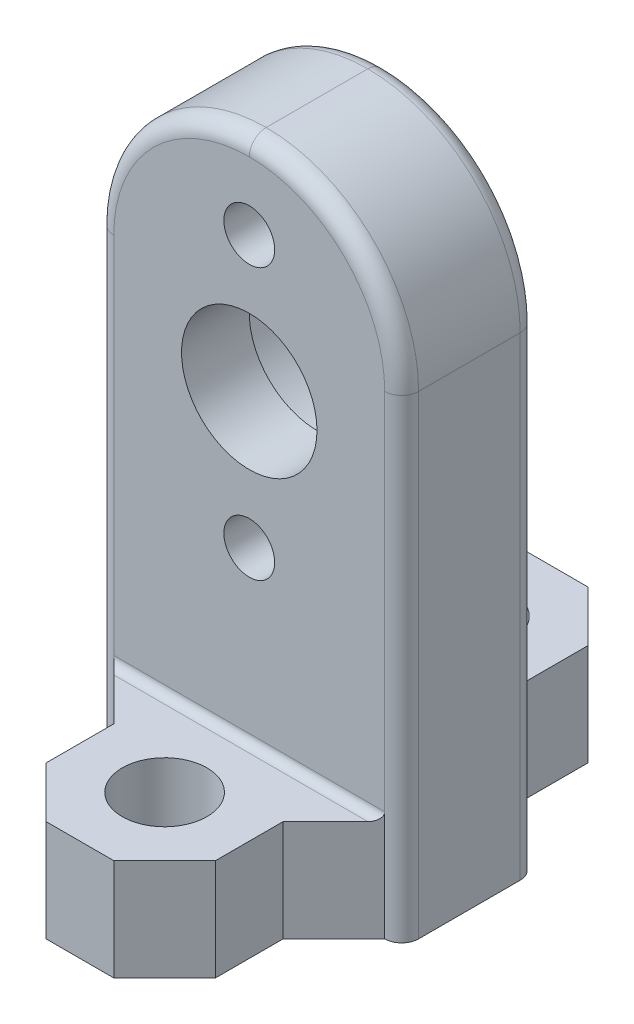
ISO-10303-21;
HEADER;
FILE_DESCRIPTION(('STEP AP214'),'2;1');
FILE_NAME('part.step','',(''),(''),'','','');
FILE_SCHEMA(('AUTOMOTIVE_DESIGN { 1 0 10303 214 1 1 1 1 }'));
ENDSEC;
DATA;
#1=APPLICATION_CONTEXT('core data for automotive mechanical design processes');
#2=APPLICATION_PROTOCOL_DEFINITION('international standard','automotive_design',2000,#1);
#3=PRODUCT_CONTEXT('',#1,'mechanical');
#4=PRODUCT('Part','Part','',(#3));
#5=PRODUCT_RELATED_PRODUCT_CATEGORY('part','',(#4));
#6=PRODUCT_DEFINITION_FORMATION('','',#4);
#7=PRODUCT_DEFINITION_CONTEXT('part definition',#1,'design');
#8=PRODUCT_DEFINITION('design','',#6,#7);
#9=PRODUCT_DEFINITION_SHAPE('','',#8);
#10=(LENGTH_UNIT() NAMED_UNIT(*) SI_UNIT(.MILLI.,.METRE.));
#11=(NAMED_UNIT(*) PLANE_ANGLE_UNIT() SI_UNIT($,.RADIAN.));
#12=(NAMED_UNIT(*) SI_UNIT($,.STERADIAN.) SOLID_ANGLE_UNIT());
#13=UNCERTAINTY_MEASURE_WITH_UNIT(LENGTH_MEASURE(1.E-05),#10,'distance_accuracy_value','');
#14=(GEOMETRIC_REPRESENTATION_CONTEXT(3) GLOBAL_UNCERTAINTY_ASSIGNED_CONTEXT((#13)) GLOBAL_UNIT_ASSIGNED_CONTEXT((#10,
#11,#12)) REPRESENTATION_CONTEXT('',''));
#15=CARTESIAN_POINT('',(0.,0.,0.));
#16=DIRECTION('',(0.,0.,1.));
#17=DIRECTION('',(1.,0.,0.));
#18=AXIS2_PLACEMENT_3D('',#15,#16,#17);
#19=CARTESIAN_POINT('',(-9.,0.,8.));
#20=DIRECTION('',(1.,0.,0.));
#21=DIRECTION('',(0.,1.,0.));
#22=AXIS2_PLACEMENT_3D('',#19,#20,#21);
#23=PLANE('',#22);
#24=DIRECTION('',(0.,0.,-1.));
#25=VECTOR('',#24,1.);
#26=CARTESIAN_POINT('',(-9.,4.,0.));
#27=LINE('',#26,#25);
#28=CARTESIAN_POINT('',(-9.,4.,7.));
#29=VERTEX_POINT('',#28);
#30=CARTESIAN_POINT('',(-9.,4.,1.));
#31=VERTEX_POINT('',#30);
#32=EDGE_CURVE('E423',#29,#31,#27,.T.);
#33=ORIENTED_EDGE('',*,*,#32,.T.);
#34=DIRECTION('',(0.,-1.,0.));
#35=VECTOR('',#34,1.);
#36=CARTESIAN_POINT('',(-9.,0.,1.));
#37=LINE('',#36,#35);
#38=CARTESIAN_POINT('',(-9.,-24.,1.));
#39=VERTEX_POINT('',#38);
#40=EDGE_CURVE('E286',#31,#39,#37,.T.);
#41=ORIENTED_EDGE('',*,*,#40,.T.);
#42=DIRECTION('',(0.,0.,-1.));
#43=VECTOR('',#42,1.);
#44=CARTESIAN_POINT('',(-9.,-24.,8.));
#45=LINE('',#44,#43);
#46=CARTESIAN_POINT('',(-9.,-24.,7.));
#47=VERTEX_POINT('',#46);
#48=EDGE_CURVE('E231',#47,#39,#45,.T.);
#49=ORIENTED_EDGE('',*,*,#48,.F.);
#50=DIRECTION('',(0.,-1.,0.));
#51=VECTOR('',#50,1.);
#52=CARTESIAN_POINT('',(-9.,4.,7.));
#53=LINE('',#52,#51);
#54=EDGE_CURVE('E284',#47,#29,#53,.F.);
#55=ORIENTED_EDGE('',*,*,#54,.T.);
#56=EDGE_LOOP('',(#33,#41,#49,#55));
#57=FACE_BOUND('',#56,.T.);
#58=ADVANCED_FACE('F35',(#57),#23,.F.);
#59=CARTESIAN_POINT('',(0.,-24.,8.));
#60=DIRECTION('',(0.,1.,0.));
#61=DIRECTION('',(0.,0.,1.));
#62=AXIS2_PLACEMENT_3D('',#59,#60,#61);
#63=PLANE('',#62);
#64=DIRECTION('',(0.,0.,-1.));
#65=VECTOR('',#64,1.);
#66=CARTESIAN_POINT('',(-5.,-24.,-10.));
#67=LINE('',#66,#65);
#68=CARTESIAN_POINT('',(-5.,-24.,-3.));
#69=VERTEX_POINT('',#68);
#70=CARTESIAN_POINT('',(-5.,-24.,-7.00000000000002));
#71=VERTEX_POINT('',#70);
#72=EDGE_CURVE('E395',#69,#71,#67,.T.);
#73=ORIENTED_EDGE('',*,*,#72,.T.);
#74=DIRECTION('',(-0.707106781186549,0.,0.707106781186546));
#75=VECTOR('',#74,1.);
#76=CARTESIAN_POINT('',(-5.,-24.,-7.00000000000002));
#77=LINE('',#76,#75);
#78=CARTESIAN_POINT('',(-2.,-24.,-10.));
#79=VERTEX_POINT('',#78);
#80=EDGE_CURVE('E353',#71,#79,#77,.F.);
#81=ORIENTED_EDGE('',*,*,#80,.T.);
#82=DIRECTION('',(1.,0.,0.));
#83=VECTOR('',#82,1.);
#84=CARTESIAN_POINT('',(5.,-24.,-10.));
#85=LINE('',#84,#83);
#86=CARTESIAN_POINT('',(2.,-24.,-10.));
#87=VERTEX_POINT('',#86);
#88=EDGE_CURVE('E394',#79,#87,#85,.T.);
#89=ORIENTED_EDGE('',*,*,#88,.T.);
#90=DIRECTION('',(-0.707106781186546,0.,-0.707106781186549));
#91=VECTOR('',#90,1.);
#92=CARTESIAN_POINT('',(2.,-24.,-10.));
#93=LINE('',#92,#91);
#94=CARTESIAN_POINT('',(5.,-24.,-6.99999999999999));
#95=VERTEX_POINT('',#94);
#96=EDGE_CURVE('E351',#87,#95,#93,.F.);
#97=ORIENTED_EDGE('',*,*,#96,.T.);
#98=DIRECTION('',(0.,0.,1.));
#99=VECTOR('',#98,1.);
#100=CARTESIAN_POINT('',(5.,-24.,-10.));
#101=LINE('',#100,#99);
#102=CARTESIAN_POINT('',(5.,-24.,-3.));
#103=VERTEX_POINT('',#102);
#104=EDGE_CURVE('E403',#95,#103,#101,.T.);
#105=ORIENTED_EDGE('',*,*,#104,.T.);
#106=DIRECTION('',(0.707106781186551,0.,0.707106781186544));
#107=VECTOR('',#106,1.);
#108=CARTESIAN_POINT('',(7.99999999999997,-24.,0.));
#109=LINE('',#108,#107);
#110=CARTESIAN_POINT('',(8.,-24.,0.));
#111=VERTEX_POINT('',#110);
#112=EDGE_CURVE('E223',#103,#111,#109,.T.);
#113=ORIENTED_EDGE('',*,*,#112,.T.);
#114=CARTESIAN_POINT('',(8.,-24.,1.));
#115=DIRECTION('',(0.,1.,0.));
#116=DIRECTION('',(0.,0.,1.));
#117=AXIS2_PLACEMENT_3D('',#114,#115,#116);
#118=CIRCLE('',#117,1.);
#119=CARTESIAN_POINT('',(9.,-24.,1.));
#120=VERTEX_POINT('',#119);
#121=EDGE_CURVE('E278',#111,#120,#118,.F.);
#122=ORIENTED_EDGE('',*,*,#121,.T.);
#123=DIRECTION('',(0.,0.,-1.));
#124=VECTOR('',#123,1.);
#125=CARTESIAN_POINT('',(9.,-24.,8.));
#126=LINE('',#125,#124);
#127=CARTESIAN_POINT('',(9.,-24.,7.));
#128=VERTEX_POINT('',#127);
#129=EDGE_CURVE('E417',#128,#120,#126,.T.);
#130=ORIENTED_EDGE('',*,*,#129,.F.);
#131=CARTESIAN_POINT('',(8.,-24.,7.));
#132=DIRECTION('',(0.,1.,0.));
#133=DIRECTION('',(0.,0.,1.));
#134=AXIS2_PLACEMENT_3D('',#131,#132,#133);
#135=CIRCLE('',#134,1.);
#136=CARTESIAN_POINT('',(8.,-24.,8.));
#137=VERTEX_POINT('',#136);
#138=EDGE_CURVE('E234',#128,#137,#135,.F.);
#139=ORIENTED_EDGE('',*,*,#138,.T.);
#140=DIRECTION('',(0.707106781186545,0.,-0.70710678118655));
#141=VECTOR('',#140,1.);
#142=CARTESIAN_POINT('',(4.00000000000003,-24.,12.));
#143=LINE('',#142,#141);
#144=CARTESIAN_POINT('',(5.,-24.,11.));
#145=VERTEX_POINT('',#144);
#146=EDGE_CURVE('E322',#137,#145,#143,.F.);
#147=ORIENTED_EDGE('',*,*,#146,.T.);
#148=CARTESIAN_POINT('',(5.,-24.,15.));
#149=VERTEX_POINT('',#148);
#150=EDGE_CURVE('E398',#145,#149,#101,.T.);
#151=ORIENTED_EDGE('',*,*,#150,.T.);
#152=DIRECTION('',(0.707106781186548,0.,-0.707106781186547));
#153=VECTOR('',#152,1.);
#154=CARTESIAN_POINT('',(5.,-24.,15.));
#155=LINE('',#154,#153);
#156=CARTESIAN_POINT('',(2.,-24.,18.));
#157=VERTEX_POINT('',#156);
#158=EDGE_CURVE('E347',#149,#157,#155,.F.);
#159=ORIENTED_EDGE('',*,*,#158,.T.);
#160=DIRECTION('',(-1.,0.,0.));
#161=VECTOR('',#160,1.);
#162=CARTESIAN_POINT('',(5.,-24.,18.));
#163=LINE('',#162,#161);
#164=CARTESIAN_POINT('',(-2.00000000000001,-24.,18.));
#165=VERTEX_POINT('',#164);
#166=EDGE_CURVE('E391',#157,#165,#163,.T.);
#167=ORIENTED_EDGE('',*,*,#166,.T.);
#168=DIRECTION('',(0.707106781186546,0.,0.707106781186549));
#169=VECTOR('',#168,1.);
#170=CARTESIAN_POINT('',(-2.00000000000001,-24.,18.));
#171=LINE('',#170,#169);
#172=CARTESIAN_POINT('',(-5.,-24.,15.));
#173=VERTEX_POINT('',#172);
#174=EDGE_CURVE('E349',#165,#173,#171,.F.);
#175=ORIENTED_EDGE('',*,*,#174,.T.);
#176=CARTESIAN_POINT('',(-5.,-24.,11.));
#177=VERTEX_POINT('',#176);
#178=EDGE_CURVE('E389',#173,#177,#67,.T.);
#179=ORIENTED_EDGE('',*,*,#178,.T.);
#180=DIRECTION('',(0.707106781186544,0.,0.707106781186551));
#181=VECTOR('',#180,1.);
#182=CARTESIAN_POINT('',(-4.00000000000003,-24.,12.));
#183=LINE('',#182,#181);
#184=CARTESIAN_POINT('',(-8.,-24.,8.));
#185=VERTEX_POINT('',#184);
#186=EDGE_CURVE('E336',#177,#185,#183,.F.);
#187=ORIENTED_EDGE('',*,*,#186,.T.);
#188=CARTESIAN_POINT('',(-8.,-24.,7.));
#189=DIRECTION('',(0.,1.,0.));
#190=DIRECTION('',(0.,0.,1.));
#191=AXIS2_PLACEMENT_3D('',#188,#189,#190);
#192=CIRCLE('',#191,1.);
#193=EDGE_CURVE('E235',#185,#47,#192,.F.);
#194=ORIENTED_EDGE('',*,*,#193,.T.);
#195=ORIENTED_EDGE('',*,*,#48,.T.);
#196=CARTESIAN_POINT('',(-8.,-24.,1.));
#197=DIRECTION('',(0.,1.,0.));
#198=DIRECTION('',(0.,0.,1.));
#199=AXIS2_PLACEMENT_3D('',#196,#197,#198);
#200=CIRCLE('',#199,1.);
#201=CARTESIAN_POINT('',(-8.,-24.,0.));
#202=VERTEX_POINT('',#201);
#203=EDGE_CURVE('E227',#39,#202,#200,.F.);
#204=ORIENTED_EDGE('',*,*,#203,.T.);
#205=DIRECTION('',(0.707106781186551,0.,-0.707106781186544));
#206=VECTOR('',#205,1.);
#207=CARTESIAN_POINT('',(-7.99999999999997,-24.,0.));
#208=LINE('',#207,#206);
#209=EDGE_CURVE('E211',#202,#69,#208,.T.);
#210=ORIENTED_EDGE('',*,*,#209,.T.);
#211=EDGE_LOOP('',(#73,#81,#89,#97,#105,#113,#122,#130,#139,#147,#151,#159,#167,#175,#179,#187,
#194,#195,#204,#210));
#212=FACE_BOUND('',#211,.T.);
#213=CARTESIAN_POINT('',(0.,-24.,-5.));
#214=DIRECTION('',(0.,-1.,0.));
#215=DIRECTION('',(0.,0.,1.));
#216=AXIS2_PLACEMENT_3D('',#213,#214,#215);
#217=CIRCLE('',#216,2.5);
#218=CARTESIAN_POINT('',(0.,-24.,-2.5));
#219=VERTEX_POINT('',#218);
#220=EDGE_CURVE('E298',#219,#219,#217,.T.);
#221=ORIENTED_EDGE('',*,*,#220,.F.);
#222=EDGE_LOOP('',(#221));
#223=FACE_BOUND('',#222,.T.);
#224=CARTESIAN_POINT('',(0.,-24.,13.));
#225=DIRECTION('',(0.,-1.,0.));
#226=DIRECTION('',(0.,0.,-1.));
#227=AXIS2_PLACEMENT_3D('',#224,#225,#226);
#228=CIRCLE('',#227,2.5);
#229=CARTESIAN_POINT('',(0.,-24.,10.5));
#230=VERTEX_POINT('',#229);
#231=EDGE_CURVE('E485',#230,#230,#228,.T.);
#232=ORIENTED_EDGE('',*,*,#231,.F.);
#233=EDGE_LOOP('',(#232));
#234=FACE_BOUND('',#233,.T.);
#235=ADVANCED_FACE('F228',(#212,#223,#234),#63,.F.);
#236=CARTESIAN_POINT('',(9.,0.,8.));
#237=DIRECTION('',(1.,0.,0.));
#238=DIRECTION('',(0.,1.,0.));
#239=AXIS2_PLACEMENT_3D('',#236,#237,#238);
#240=PLANE('',#239);
#241=ORIENTED_EDGE('',*,*,#129,.T.);
#242=DIRECTION('',(0.,-1.,0.));
#243=VECTOR('',#242,1.);
#244=CARTESIAN_POINT('',(9.,4.,1.));
#245=LINE('',#244,#243);
#246=CARTESIAN_POINT('',(9.,4.,1.));
#247=VERTEX_POINT('',#246);
#248=EDGE_CURVE('E282',#120,#247,#245,.F.);
#249=ORIENTED_EDGE('',*,*,#248,.T.);
#250=DIRECTION('',(0.,0.,-1.));
#251=VECTOR('',#250,1.);
#252=CARTESIAN_POINT('',(9.,4.,8.));
#253=LINE('',#252,#251);
#254=CARTESIAN_POINT('',(9.,4.,7.));
#255=VERTEX_POINT('',#254);
#256=EDGE_CURVE('E426',#247,#255,#253,.F.);
#257=ORIENTED_EDGE('',*,*,#256,.T.);
#258=DIRECTION('',(0.,-1.,0.));
#259=VECTOR('',#258,1.);
#260=CARTESIAN_POINT('',(9.,0.,7.));
#261=LINE('',#260,#259);
#262=EDGE_CURVE('E280',#255,#128,#261,.T.);
#263=ORIENTED_EDGE('',*,*,#262,.T.);
#264=EDGE_LOOP('',(#241,#249,#257,#263));
#265=FACE_BOUND('',#264,.T.);
#266=ADVANCED_FACE('F532',(#265),#240,.T.);
#267=CARTESIAN_POINT('',(0.,0.,8.));
#268=DIRECTION('',(0.,0.,1.));
#269=DIRECTION('',(1.,0.,0.));
#270=AXIS2_PLACEMENT_3D('',#267,#268,#269);
#271=PLANE('',#270);
#272=CARTESIAN_POINT('',(0.,8.,8.));
#273=DIRECTION('',(0.,0.,1.));
#274=DIRECTION('',(1.,0.,0.));
#275=AXIS2_PLACEMENT_3D('',#272,#273,#274);
#276=CIRCLE('',#275,1.5);
#277=CARTESIAN_POINT('',(1.49999999999994,8.,8.));
#278=VERTEX_POINT('',#277);
#279=EDGE_CURVE('E302',#278,#278,#276,.T.);
#280=ORIENTED_EDGE('',*,*,#279,.F.);
#281=EDGE_LOOP('',(#280));
#282=FACE_BOUND('',#281,.T.);
#283=CARTESIAN_POINT('',(1.12707120282298E-13,-8.,8.));
#284=DIRECTION('',(0.,0.,1.));
#285=DIRECTION('',(1.,0.,0.));
#286=AXIS2_PLACEMENT_3D('',#283,#284,#285);
#287=CIRCLE('',#286,1.5);
#288=CARTESIAN_POINT('',(1.50000000000011,-8.,8.));
#289=VERTEX_POINT('',#288);
#290=EDGE_CURVE('E792',#289,#289,#287,.T.);
#291=ORIENTED_EDGE('',*,*,#290,.F.);
#292=EDGE_LOOP('',(#291));
#293=FACE_BOUND('',#292,.T.);
#294=DIRECTION('',(1.,0.,0.));
#295=VECTOR('',#294,1.);
#296=CARTESIAN_POINT('',(0.,-17.5,8.));
#297=LINE('',#296,#295);
#298=CARTESIAN_POINT('',(-8.,-17.5,8.));
#299=VERTEX_POINT('',#298);
#300=CARTESIAN_POINT('',(8.,-17.5,8.));
#301=VERTEX_POINT('',#300);
#302=EDGE_CURVE('E434',#299,#301,#297,.T.);
#303=ORIENTED_EDGE('',*,*,#302,.T.);
#304=DIRECTION('',(0.,-1.,0.));
#305=VECTOR('',#304,1.);
#306=CARTESIAN_POINT('',(8.,0.,8.));
#307=LINE('',#306,#305);
#308=CARTESIAN_POINT('',(8.,4.,8.));
#309=VERTEX_POINT('',#308);
#310=EDGE_CURVE('E272',#301,#309,#307,.F.);
#311=ORIENTED_EDGE('',*,*,#310,.T.);
#312=CARTESIAN_POINT('',(0.,4.,8.));
#313=DIRECTION('',(0.,0.,1.));
#314=DIRECTION('',(1.,0.,0.));
#315=AXIS2_PLACEMENT_3D('',#312,#313,#314);
#316=CIRCLE('',#315,8.);
#317=CARTESIAN_POINT('',(0.,12.,8.));
#318=VERTEX_POINT('',#317);
#319=EDGE_CURVE('E269',#309,#318,#316,.T.);
#320=ORIENTED_EDGE('',*,*,#319,.T.);
#321=CARTESIAN_POINT('',(0.,4.,8.));
#322=DIRECTION('',(0.,0.,1.));
#323=DIRECTION('',(1.,0.,0.));
#324=AXIS2_PLACEMENT_3D('',#321,#322,#323);
#325=CIRCLE('',#324,8.);
#326=CARTESIAN_POINT('',(-8.,4.,8.));
#327=VERTEX_POINT('',#326);
#328=EDGE_CURVE('E267',#318,#327,#325,.T.);
#329=ORIENTED_EDGE('',*,*,#328,.T.);
#330=DIRECTION('',(0.,-1.,0.));
#331=VECTOR('',#330,1.);
#332=CARTESIAN_POINT('',(-8.,-24.,8.));
#333=LINE('',#332,#331);
#334=EDGE_CURVE('E264',#327,#299,#333,.T.);
#335=ORIENTED_EDGE('',*,*,#334,.T.);
#336=EDGE_LOOP('',(#303,#311,#320,#329,#335));
#337=FACE_BOUND('',#336,.T.);
#338=CARTESIAN_POINT('',(0.,0.,8.));
#339=DIRECTION('',(0.,0.,1.));
#340=DIRECTION('',(1.,0.,0.));
#341=AXIS2_PLACEMENT_3D('',#338,#339,#340);
#342=CIRCLE('',#341,4.);
#343=CARTESIAN_POINT('',(4.,0.,8.));
#344=VERTEX_POINT('',#343);
#345=EDGE_CURVE('E407',#344,#344,#342,.T.);
#346=ORIENTED_EDGE('',*,*,#345,.F.);
#347=EDGE_LOOP('',(#346));
#348=FACE_BOUND('',#347,.T.);
#349=ADVANCED_FACE('F509',(#282,#293,#337,#348),#271,.T.);
#350=CARTESIAN_POINT('',(0.,0.,0.));
#351=DIRECTION('',(0.,0.,1.));
#352=DIRECTION('',(1.,0.,0.));
#353=AXIS2_PLACEMENT_3D('',#350,#351,#352);
#354=PLANE('',#353);
#355=CARTESIAN_POINT('',(0.,8.,0.));
#356=DIRECTION('',(0.,0.,-1.));
#357=DIRECTION('',(1.,0.,0.));
#358=AXIS2_PLACEMENT_3D('',#355,#356,#357);
#359=CIRCLE('',#358,1.5);
#360=CARTESIAN_POINT('',(1.49999999999994,8.,0.));
#361=VERTEX_POINT('',#360);
#362=EDGE_CURVE('E791',#361,#361,#359,.T.);
#363=ORIENTED_EDGE('',*,*,#362,.F.);
#364=EDGE_LOOP('',(#363));
#365=FACE_BOUND('',#364,.T.);
#366=CARTESIAN_POINT('',(1.12707120282298E-13,-8.,0.));
#367=DIRECTION('',(0.,0.,-1.));
#368=DIRECTION('',(1.,0.,0.));
#369=AXIS2_PLACEMENT_3D('',#366,#367,#368);
#370=CIRCLE('',#369,1.5);
#371=CARTESIAN_POINT('',(1.50000000000011,-8.,0.));
#372=VERTEX_POINT('',#371);
#373=EDGE_CURVE('E793',#372,#372,#370,.T.);
#374=ORIENTED_EDGE('',*,*,#373,.F.);
#375=EDGE_LOOP('',(#374));
#376=FACE_BOUND('',#375,.T.);
#377=CARTESIAN_POINT('',(0.,0.,0.));
#378=DIRECTION('',(0.,0.,1.));
#379=DIRECTION('',(1.,0.,0.));
#380=AXIS2_PLACEMENT_3D('',#377,#378,#379);
#381=CIRCLE('',#380,6.);
#382=CARTESIAN_POINT('',(6.,0.,0.));
#383=VERTEX_POINT('',#382);
#384=EDGE_CURVE('E413',#383,#383,#381,.T.);
#385=ORIENTED_EDGE('',*,*,#384,.T.);
#386=EDGE_LOOP('',(#385));
#387=FACE_BOUND('',#386,.T.);
#388=DIRECTION('',(0.,-1.,0.));
#389=VECTOR('',#388,1.);
#390=CARTESIAN_POINT('',(8.,-24.,0.));
#391=LINE('',#390,#389);
#392=CARTESIAN_POINT('',(8.,4.,0.));
#393=VERTEX_POINT('',#392);
#394=CARTESIAN_POINT('',(8.,-17.5,0.));
#395=VERTEX_POINT('',#394);
#396=EDGE_CURVE('E252',#393,#395,#391,.T.);
#397=ORIENTED_EDGE('',*,*,#396,.T.);
#398=DIRECTION('',(1.,0.,0.));
#399=VECTOR('',#398,1.);
#400=CARTESIAN_POINT('',(-5.,-17.5,0.));
#401=LINE('',#400,#399);
#402=CARTESIAN_POINT('',(-8.,-17.5,0.));
#403=VERTEX_POINT('',#402);
#404=EDGE_CURVE('E433',#395,#403,#401,.F.);
#405=ORIENTED_EDGE('',*,*,#404,.T.);
#406=DIRECTION('',(0.,-1.,0.));
#407=VECTOR('',#406,1.);
#408=CARTESIAN_POINT('',(-8.,0.,0.));
#409=LINE('',#408,#407);
#410=CARTESIAN_POINT('',(-8.,4.,0.));
#411=VERTEX_POINT('',#410);
#412=EDGE_CURVE('E240',#403,#411,#409,.F.);
#413=ORIENTED_EDGE('',*,*,#412,.T.);
#414=CARTESIAN_POINT('',(0.,4.,0.));
#415=DIRECTION('',(0.,0.,1.));
#416=DIRECTION('',(1.,0.,0.));
#417=AXIS2_PLACEMENT_3D('',#414,#415,#416);
#418=CIRCLE('',#417,8.);
#419=CARTESIAN_POINT('',(0.,12.,0.));
#420=VERTEX_POINT('',#419);
#421=EDGE_CURVE('E241',#411,#420,#418,.F.);
#422=ORIENTED_EDGE('',*,*,#421,.T.);
#423=CARTESIAN_POINT('',(0.,4.,0.));
#424=DIRECTION('',(0.,0.,1.));
#425=DIRECTION('',(1.,0.,0.));
#426=AXIS2_PLACEMENT_3D('',#423,#424,#425);
#427=CIRCLE('',#426,8.);
#428=EDGE_CURVE('E243',#420,#393,#427,.F.);
#429=ORIENTED_EDGE('',*,*,#428,.T.);
#430=EDGE_LOOP('',(#397,#405,#413,#422,#429));
#431=FACE_BOUND('',#430,.T.);
#432=ADVANCED_FACE('F469',(#365,#376,#387,#431),#354,.F.);
#433=CARTESIAN_POINT('',(0.,0.,4.));
#434=DIRECTION('',(0.,0.,-1.));
#435=DIRECTION('',(-1.,0.,0.));
#436=AXIS2_PLACEMENT_3D('',#433,#434,#435);
#437=CYLINDRICAL_SURFACE('',#436,6.);
#438=CARTESIAN_POINT('',(0.,0.,4.));
#439=DIRECTION('',(0.,0.,1.));
#440=DIRECTION('',(1.,0.,0.));
#441=AXIS2_PLACEMENT_3D('',#438,#439,#440);
#442=CIRCLE('',#441,6.);
#443=CARTESIAN_POINT('',(6.,0.,4.));
#444=VERTEX_POINT('',#443);
#445=EDGE_CURVE('E414',#444,#444,#442,.T.);
#446=ORIENTED_EDGE('',*,*,#445,.T.);
#447=EDGE_LOOP('',(#446));
#448=FACE_BOUND('',#447,.T.);
#449=ORIENTED_EDGE('',*,*,#384,.F.);
#450=EDGE_LOOP('',(#449));
#451=FACE_BOUND('',#450,.T.);
#452=ADVANCED_FACE('F763',(#448,#451),#437,.F.);
#453=CARTESIAN_POINT('',(0.,0.,4.));
#454=DIRECTION('',(0.,0.,1.));
#455=DIRECTION('',(1.,0.,0.));
#456=AXIS2_PLACEMENT_3D('',#453,#454,#455);
#457=PLANE('',#456);
#458=CARTESIAN_POINT('',(0.,0.,4.));
#459=DIRECTION('',(0.,0.,1.));
#460=DIRECTION('',(1.,0.,0.));
#461=AXIS2_PLACEMENT_3D('',#458,#459,#460);
#462=CIRCLE('',#461,4.);
#463=CARTESIAN_POINT('',(4.,0.,4.));
#464=VERTEX_POINT('',#463);
#465=EDGE_CURVE('E410',#464,#464,#462,.F.);
#466=ORIENTED_EDGE('',*,*,#465,.F.);
#467=EDGE_LOOP('',(#466));
#468=FACE_BOUND('',#467,.T.);
#469=ORIENTED_EDGE('',*,*,#445,.F.);
#470=EDGE_LOOP('',(#469));
#471=FACE_BOUND('',#470,.T.);
#472=ADVANCED_FACE('F768',(#468,#471),#457,.F.);
#473=CARTESIAN_POINT('',(0.,0.,-7.31370849898476));
#474=DIRECTION('',(0.,0.,1.));
#475=DIRECTION('',(1.,0.,0.));
#476=AXIS2_PLACEMENT_3D('',#473,#474,#475);
#477=CYLINDRICAL_SURFACE('',#476,4.);
#478=ORIENTED_EDGE('',*,*,#465,.T.);
#479=EDGE_LOOP('',(#478));
#480=FACE_BOUND('',#479,.T.);
#481=ORIENTED_EDGE('',*,*,#345,.T.);
#482=EDGE_LOOP('',(#481));
#483=FACE_BOUND('',#482,.T.);
#484=ADVANCED_FACE('F542',(#480,#483),#477,.F.);
#485=CARTESIAN_POINT('',(0.,4.,8.));
#486=DIRECTION('',(0.,0.,-1.));
#487=DIRECTION('',(-1.,0.,0.));
#488=AXIS2_PLACEMENT_3D('',#485,#486,#487);
#489=CYLINDRICAL_SURFACE('',#488,9.);
#490=ORIENTED_EDGE('',*,*,#256,.F.);
#491=CARTESIAN_POINT('',(0.,4.,1.));
#492=DIRECTION('',(0.,0.,1.));
#493=DIRECTION('',(1.,0.,0.));
#494=AXIS2_PLACEMENT_3D('',#491,#492,#493);
#495=CIRCLE('',#494,9.);
#496=CARTESIAN_POINT('',(0.,13.,1.));
#497=VERTEX_POINT('',#496);
#498=EDGE_CURVE('E257',#247,#497,#495,.T.);
#499=ORIENTED_EDGE('',*,*,#498,.T.);
#500=DIRECTION('',(0.,0.,-1.));
#501=VECTOR('',#500,1.);
#502=CARTESIAN_POINT('',(0.,13.,8.));
#503=LINE('',#502,#501);
#504=CARTESIAN_POINT('',(0.,13.,7.));
#505=VERTEX_POINT('',#504);
#506=EDGE_CURVE('E385',#505,#497,#503,.T.);
#507=ORIENTED_EDGE('',*,*,#506,.F.);
#508=CARTESIAN_POINT('',(0.,4.,7.));
#509=DIRECTION('',(0.,0.,1.));
#510=DIRECTION('',(1.,0.,0.));
#511=AXIS2_PLACEMENT_3D('',#508,#509,#510);
#512=CIRCLE('',#511,9.);
#513=EDGE_CURVE('E255',#505,#255,#512,.F.);
#514=ORIENTED_EDGE('',*,*,#513,.T.);
#515=EDGE_LOOP('',(#490,#499,#507,#514));
#516=FACE_BOUND('',#515,.T.);
#517=ADVANCED_FACE('F539',(#516),#489,.T.);
#518=CARTESIAN_POINT('',(0.,4.,8.));
#519=DIRECTION('',(0.,0.,1.));
#520=DIRECTION('',(1.,0.,0.));
#521=AXIS2_PLACEMENT_3D('',#518,#519,#520);
#522=CYLINDRICAL_SURFACE('',#521,9.);
#523=ORIENTED_EDGE('',*,*,#506,.T.);
#524=CARTESIAN_POINT('',(0.,4.,1.));
#525=DIRECTION('',(0.,0.,1.));
#526=DIRECTION('',(1.,0.,0.));
#527=AXIS2_PLACEMENT_3D('',#524,#525,#526);
#528=CIRCLE('',#527,9.);
#529=EDGE_CURVE('E261',#497,#31,#528,.T.);
#530=ORIENTED_EDGE('',*,*,#529,.T.);
#531=ORIENTED_EDGE('',*,*,#32,.F.);
#532=CARTESIAN_POINT('',(0.,4.,7.));
#533=DIRECTION('',(0.,0.,1.));
#534=DIRECTION('',(1.,0.,0.));
#535=AXIS2_PLACEMENT_3D('',#532,#533,#534);
#536=CIRCLE('',#535,9.);
#537=EDGE_CURVE('E259',#29,#505,#536,.F.);
#538=ORIENTED_EDGE('',*,*,#537,.T.);
#539=EDGE_LOOP('',(#523,#530,#531,#538));
#540=FACE_BOUND('',#539,.T.);
#541=ADVANCED_FACE('F455',(#540),#522,.T.);
#542=CARTESIAN_POINT('',(5.,-18.,-10.));
#543=DIRECTION('',(0.,0.,-1.));
#544=DIRECTION('',(-1.,0.,0.));
#545=AXIS2_PLACEMENT_3D('',#542,#543,#544);
#546=PLANE('',#545);
#547=ORIENTED_EDGE('',*,*,#88,.F.);
#548=DIRECTION('',(0.,1.,0.));
#549=VECTOR('',#548,1.);
#550=CARTESIAN_POINT('',(-2.,-18.,-10.));
#551=LINE('',#550,#549);
#552=CARTESIAN_POINT('',(-2.,-18.,-10.));
#553=VERTEX_POINT('',#552);
#554=EDGE_CURVE('E358',#79,#553,#551,.T.);
#555=ORIENTED_EDGE('',*,*,#554,.T.);
#556=DIRECTION('',(1.,0.,0.));
#557=VECTOR('',#556,1.);
#558=CARTESIAN_POINT('',(5.,-18.,-10.));
#559=LINE('',#558,#557);
#560=CARTESIAN_POINT('',(2.,-18.,-10.));
#561=VERTEX_POINT('',#560);
#562=EDGE_CURVE('E482',#553,#561,#559,.T.);
#563=ORIENTED_EDGE('',*,*,#562,.T.);
#564=DIRECTION('',(0.,-1.,0.));
#565=VECTOR('',#564,1.);
#566=CARTESIAN_POINT('',(2.,-18.,-10.));
#567=LINE('',#566,#565);
#568=EDGE_CURVE('E355',#561,#87,#567,.T.);
#569=ORIENTED_EDGE('',*,*,#568,.T.);
#570=EDGE_LOOP('',(#547,#555,#563,#569));
#571=FACE_BOUND('',#570,.T.);
#572=ADVANCED_FACE('F538',(#571),#546,.T.);
#573=CARTESIAN_POINT('',(0.,-18.,-5.));
#574=DIRECTION('',(0.,-1.,0.));
#575=DIRECTION('',(0.,0.,-1.));
#576=AXIS2_PLACEMENT_3D('',#573,#574,#575);
#577=CYLINDRICAL_SURFACE('',#576,2.5);
#578=CARTESIAN_POINT('',(0.,-18.,-5.));
#579=DIRECTION('',(0.,-1.,0.));
#580=DIRECTION('',(0.,0.,1.));
#581=AXIS2_PLACEMENT_3D('',#578,#579,#580);
#582=CIRCLE('',#581,2.5);
#583=CARTESIAN_POINT('',(0.,-18.,-2.5));
#584=VERTEX_POINT('',#583);
#585=EDGE_CURVE('E801',#584,#584,#582,.T.);
#586=ORIENTED_EDGE('',*,*,#585,.F.);
#587=EDGE_LOOP('',(#586));
#588=FACE_BOUND('',#587,.T.);
#589=ORIENTED_EDGE('',*,*,#220,.T.);
#590=EDGE_LOOP('',(#589));
#591=FACE_BOUND('',#590,.T.);
#592=ADVANCED_FACE('F644',(#588,#591),#577,.F.);
#593=CARTESIAN_POINT('',(0.,-18.,0.));
#594=DIRECTION('',(0.,-1.,0.));
#595=DIRECTION('',(0.,0.,-1.));
#596=AXIS2_PLACEMENT_3D('',#593,#594,#595);
#597=PLANE('',#596);
#598=ORIENTED_EDGE('',*,*,#585,.T.);
#599=EDGE_LOOP('',(#598));
#600=FACE_BOUND('',#599,.T.);
#601=ORIENTED_EDGE('',*,*,#562,.F.);
#602=DIRECTION('',(0.707106781186549,0.,-0.707106781186546));
#603=VECTOR('',#602,1.);
#604=CARTESIAN_POINT('',(-5.,-18.,-7.00000000000002));
#605=LINE('',#604,#603);
#606=CARTESIAN_POINT('',(-5.,-18.,-7.00000000000002));
#607=VERTEX_POINT('',#606);
#608=EDGE_CURVE('E362',#553,#607,#605,.F.);
#609=ORIENTED_EDGE('',*,*,#608,.T.);
#610=DIRECTION('',(0.,0.,-1.));
#611=VECTOR('',#610,1.);
#612=CARTESIAN_POINT('',(-5.,-18.,-10.));
#613=LINE('',#612,#611);
#614=CARTESIAN_POINT('',(-5.,-18.,-3.));
#615=VERTEX_POINT('',#614);
#616=EDGE_CURVE('E406',#615,#607,#613,.T.);
#617=ORIENTED_EDGE('',*,*,#616,.F.);
#618=DIRECTION('',(-0.707106781186551,0.,0.707106781186544));
#619=VECTOR('',#618,1.);
#620=CARTESIAN_POINT('',(-3.99999999999997,-18.,-4.00000000000001));
#621=LINE('',#620,#619);
#622=CARTESIAN_POINT('',(-7.50000000000002,-18.,-0.5));
#623=VERTEX_POINT('',#622);
#624=EDGE_CURVE('E222',#615,#623,#621,.T.);
#625=ORIENTED_EDGE('',*,*,#624,.T.);
#626=DIRECTION('',(1.,0.,0.));
#627=VECTOR('',#626,1.);
#628=CARTESIAN_POINT('',(5.,-18.,-0.5));
#629=LINE('',#628,#627);
#630=CARTESIAN_POINT('',(7.50000000000002,-18.,-0.5));
#631=VERTEX_POINT('',#630);
#632=EDGE_CURVE('E429',#623,#631,#629,.T.);
#633=ORIENTED_EDGE('',*,*,#632,.T.);
#634=DIRECTION('',(-0.707106781186551,0.,-0.707106781186544));
#635=VECTOR('',#634,1.);
#636=CARTESIAN_POINT('',(3.99999999999997,-18.,-4.00000000000001));
#637=LINE('',#636,#635);
#638=CARTESIAN_POINT('',(5.,-18.,-3.));
#639=VERTEX_POINT('',#638);
#640=EDGE_CURVE('E327',#631,#639,#637,.T.);
#641=ORIENTED_EDGE('',*,*,#640,.T.);
#642=DIRECTION('',(0.,0.,1.));
#643=VECTOR('',#642,1.);
#644=CARTESIAN_POINT('',(5.,-18.,-10.));
#645=LINE('',#644,#643);
#646=CARTESIAN_POINT('',(5.,-18.,-6.99999999999999));
#647=VERTEX_POINT('',#646);
#648=EDGE_CURVE('E386',#647,#639,#645,.T.);
#649=ORIENTED_EDGE('',*,*,#648,.F.);
#650=DIRECTION('',(0.707106781186546,0.,0.707106781186549));
#651=VECTOR('',#650,1.);
#652=CARTESIAN_POINT('',(2.,-18.,-10.));
#653=LINE('',#652,#651);
#654=EDGE_CURVE('E360',#647,#561,#653,.F.);
#655=ORIENTED_EDGE('',*,*,#654,.T.);
#656=EDGE_LOOP('',(#601,#609,#617,#625,#633,#641,#649,#655));
#657=FACE_BOUND('',#656,.T.);
#658=ADVANCED_FACE('F476',(#600,#657),#597,.F.);
#659=CARTESIAN_POINT('',(5.,-18.,-10.));
#660=DIRECTION('',(1.,0.,0.));
#661=DIRECTION('',(0.,0.,-1.));
#662=AXIS2_PLACEMENT_3D('',#659,#660,#661);
#663=PLANE('',#662);
#664=ORIENTED_EDGE('',*,*,#104,.F.);
#665=DIRECTION('',(0.,1.,0.));
#666=VECTOR('',#665,1.);
#667=CARTESIAN_POINT('',(5.,-18.,-6.99999999999999));
#668=LINE('',#667,#666);
#669=EDGE_CURVE('E364',#95,#647,#668,.T.);
#670=ORIENTED_EDGE('',*,*,#669,.T.);
#671=ORIENTED_EDGE('',*,*,#648,.T.);
#672=DIRECTION('',(0.,-1.,0.));
#673=VECTOR('',#672,1.);
#674=CARTESIAN_POINT('',(5.,-18.,-3.));
#675=LINE('',#674,#673);
#676=EDGE_CURVE('E309',#639,#103,#675,.T.);
#677=ORIENTED_EDGE('',*,*,#676,.T.);
#678=EDGE_LOOP('',(#664,#670,#671,#677));
#679=FACE_BOUND('',#678,.T.);
#680=ADVANCED_FACE('F656',(#679),#663,.T.);
#681=CARTESIAN_POINT('',(-5.,-18.,-10.));
#682=DIRECTION('',(-1.,0.,0.));
#683=DIRECTION('',(0.,0.,1.));
#684=AXIS2_PLACEMENT_3D('',#681,#682,#683);
#685=PLANE('',#684);
#686=ORIENTED_EDGE('',*,*,#616,.T.);
#687=DIRECTION('',(0.,-1.,0.));
#688=VECTOR('',#687,1.);
#689=CARTESIAN_POINT('',(-5.,-18.,-7.00000000000002));
#690=LINE('',#689,#688);
#691=EDGE_CURVE('E344',#607,#71,#690,.T.);
#692=ORIENTED_EDGE('',*,*,#691,.T.);
#693=ORIENTED_EDGE('',*,*,#72,.F.);
#694=DIRECTION('',(0.,1.,0.));
#695=VECTOR('',#694,1.);
#696=CARTESIAN_POINT('',(-5.,-18.,-3.));
#697=LINE('',#696,#695);
#698=EDGE_CURVE('E218',#69,#615,#697,.T.);
#699=ORIENTED_EDGE('',*,*,#698,.T.);
#700=EDGE_LOOP('',(#686,#692,#693,#699));
#701=FACE_BOUND('',#700,.T.);
#702=ADVANCED_FACE('F666',(#701),#685,.T.);
#703=ORIENTED_EDGE('',*,*,#178,.F.);
#704=DIRECTION('',(0.,1.,0.));
#705=VECTOR('',#704,1.);
#706=CARTESIAN_POINT('',(-5.,-18.,15.));
#707=LINE('',#706,#705);
#708=CARTESIAN_POINT('',(-5.,-18.,15.));
#709=VERTEX_POINT('',#708);
#710=EDGE_CURVE('E58',#173,#709,#707,.T.);
#711=ORIENTED_EDGE('',*,*,#710,.T.);
#712=CARTESIAN_POINT('',(-5.,-18.,11.));
#713=VERTEX_POINT('',#712);
#714=EDGE_CURVE('E377',#709,#713,#613,.T.);
#715=ORIENTED_EDGE('',*,*,#714,.T.);
#716=DIRECTION('',(0.,-1.,0.));
#717=VECTOR('',#716,1.);
#718=CARTESIAN_POINT('',(-5.,-24.,11.));
#719=LINE('',#718,#717);
#720=EDGE_CURVE('E313',#713,#177,#719,.T.);
#721=ORIENTED_EDGE('',*,*,#720,.T.);
#722=EDGE_LOOP('',(#703,#711,#715,#721));
#723=FACE_BOUND('',#722,.T.);
#724=ADVANCED_FACE('F392',(#723),#685,.T.);
#725=CARTESIAN_POINT('',(5.,-18.,18.));
#726=DIRECTION('',(0.,0.,1.));
#727=DIRECTION('',(1.,0.,0.));
#728=AXIS2_PLACEMENT_3D('',#725,#726,#727);
#729=PLANE('',#728);
#730=DIRECTION('',(-1.,0.,0.));
#731=VECTOR('',#730,1.);
#732=CARTESIAN_POINT('',(5.,-18.,18.));
#733=LINE('',#732,#731);
#734=CARTESIAN_POINT('',(2.,-18.,18.));
#735=VERTEX_POINT('',#734);
#736=CARTESIAN_POINT('',(-2.00000000000001,-18.,18.));
#737=VERTEX_POINT('',#736);
#738=EDGE_CURVE('E376',#735,#737,#733,.T.);
#739=ORIENTED_EDGE('',*,*,#738,.T.);
#740=DIRECTION('',(0.,-1.,0.));
#741=VECTOR('',#740,1.);
#742=CARTESIAN_POINT('',(-2.00000000000001,-18.,18.));
#743=LINE('',#742,#741);
#744=EDGE_CURVE('E368',#737,#165,#743,.T.);
#745=ORIENTED_EDGE('',*,*,#744,.T.);
#746=ORIENTED_EDGE('',*,*,#166,.F.);
#747=DIRECTION('',(0.,1.,0.));
#748=VECTOR('',#747,1.);
#749=CARTESIAN_POINT('',(2.,-18.,18.));
#750=LINE('',#749,#748);
#751=EDGE_CURVE('E366',#157,#735,#750,.T.);
#752=ORIENTED_EDGE('',*,*,#751,.T.);
#753=EDGE_LOOP('',(#739,#745,#746,#752));
#754=FACE_BOUND('',#753,.T.);
#755=ADVANCED_FACE('F381',(#754),#729,.T.);
#756=CARTESIAN_POINT('',(5.,-18.,11.));
#757=VERTEX_POINT('',#756);
#758=CARTESIAN_POINT('',(5.,-18.,15.));
#759=VERTEX_POINT('',#758);
#760=EDGE_CURVE('E488',#757,#759,#645,.T.);
#761=ORIENTED_EDGE('',*,*,#760,.T.);
#762=DIRECTION('',(0.,-1.,0.));
#763=VECTOR('',#762,1.);
#764=CARTESIAN_POINT('',(5.,-18.,15.));
#765=LINE('',#764,#763);
#766=EDGE_CURVE('E11',#759,#149,#765,.T.);
#767=ORIENTED_EDGE('',*,*,#766,.T.);
#768=ORIENTED_EDGE('',*,*,#150,.F.);
#769=DIRECTION('',(0.,1.,0.));
#770=VECTOR('',#769,1.);
#771=CARTESIAN_POINT('',(5.,-17.5,11.));
#772=LINE('',#771,#770);
#773=EDGE_CURVE('E288',#145,#757,#772,.T.);
#774=ORIENTED_EDGE('',*,*,#773,.T.);
#775=EDGE_LOOP('',(#761,#767,#768,#774));
#776=FACE_BOUND('',#775,.T.);
#777=ADVANCED_FACE('F493',(#776),#663,.T.);
#778=ORIENTED_EDGE('',*,*,#714,.F.);
#779=DIRECTION('',(-0.707106781186546,0.,-0.707106781186549));
#780=VECTOR('',#779,1.);
#781=CARTESIAN_POINT('',(-2.00000000000001,-18.,18.));
#782=LINE('',#781,#780);
#783=EDGE_CURVE('E43',#709,#737,#782,.F.);
#784=ORIENTED_EDGE('',*,*,#783,.T.);
#785=ORIENTED_EDGE('',*,*,#738,.F.);
#786=DIRECTION('',(-0.707106781186548,0.,0.707106781186547));
#787=VECTOR('',#786,1.);
#788=CARTESIAN_POINT('',(5.,-18.,15.));
#789=LINE('',#788,#787);
#790=EDGE_CURVE('E50',#735,#759,#789,.F.);
#791=ORIENTED_EDGE('',*,*,#790,.T.);
#792=ORIENTED_EDGE('',*,*,#760,.F.);
#793=DIRECTION('',(-0.707106781186545,0.,0.70710678118655));
#794=VECTOR('',#793,1.);
#795=CARTESIAN_POINT('',(8.00000000000003,-18.,7.99999999999997));
#796=LINE('',#795,#794);
#797=CARTESIAN_POINT('',(7.5,-18.,8.5));
#798=VERTEX_POINT('',#797);
#799=EDGE_CURVE('E316',#757,#798,#796,.F.);
#800=ORIENTED_EDGE('',*,*,#799,.T.);
#801=DIRECTION('',(1.,0.,0.));
#802=VECTOR('',#801,1.);
#803=CARTESIAN_POINT('',(0.,-18.,8.5));
#804=LINE('',#803,#802);
#805=CARTESIAN_POINT('',(-7.5,-18.,8.5));
#806=VERTEX_POINT('',#805);
#807=EDGE_CURVE('E245',#798,#806,#804,.F.);
#808=ORIENTED_EDGE('',*,*,#807,.T.);
#809=DIRECTION('',(-0.707106781186544,0.,-0.707106781186551));
#810=VECTOR('',#809,1.);
#811=CARTESIAN_POINT('',(-8.00000000000003,-18.,7.99999999999996));
#812=LINE('',#811,#810);
#813=EDGE_CURVE('E341',#806,#713,#812,.F.);
#814=ORIENTED_EDGE('',*,*,#813,.T.);
#815=EDGE_LOOP('',(#778,#784,#785,#791,#792,#800,#808,#814));
#816=FACE_BOUND('',#815,.T.);
#817=CARTESIAN_POINT('',(0.,-18.,13.));
#818=DIRECTION('',(0.,-1.,0.));
#819=DIRECTION('',(0.,0.,-1.));
#820=AXIS2_PLACEMENT_3D('',#817,#818,#819);
#821=CIRCLE('',#820,2.5);
#822=CARTESIAN_POINT('',(0.,-18.,10.5));
#823=VERTEX_POINT('',#822);
#824=EDGE_CURVE('E400',#823,#823,#821,.T.);
#825=ORIENTED_EDGE('',*,*,#824,.T.);
#826=EDGE_LOOP('',(#825));
#827=FACE_BOUND('',#826,.T.);
#828=ADVANCED_FACE('F374',(#816,#827),#597,.F.);
#829=CARTESIAN_POINT('',(0.,-18.,13.));
#830=DIRECTION('',(0.,-1.,0.));
#831=DIRECTION('',(0.,0.,-1.));
#832=AXIS2_PLACEMENT_3D('',#829,#830,#831);
#833=CYLINDRICAL_SURFACE('',#832,2.5);
#834=ORIENTED_EDGE('',*,*,#824,.F.);
#835=EDGE_LOOP('',(#834));
#836=FACE_BOUND('',#835,.T.);
#837=ORIENTED_EDGE('',*,*,#231,.T.);
#838=EDGE_LOOP('',(#837));
#839=FACE_BOUND('',#838,.T.);
#840=ADVANCED_FACE('F546',(#836,#839),#833,.F.);
#841=CARTESIAN_POINT('',(0.,-17.5,-0.5));
#842=DIRECTION('',(-1.,0.,0.));
#843=DIRECTION('',(0.,0.,1.));
#844=AXIS2_PLACEMENT_3D('',#841,#842,#843);
#845=CYLINDRICAL_SURFACE('',#844,0.5);
#846=ORIENTED_EDGE('',*,*,#632,.F.);
#847=CARTESIAN_POINT('',(-7.50000000000002,-17.5,-0.5));
#848=DIRECTION('',(0.707106781186544,0.,0.707106781186551));
#849=DIRECTION('',(-0.707106781186551,0.,0.707106781186544));
#850=AXIS2_PLACEMENT_3D('',#847,#848,#849);
#851=ELLIPSE('',#850,0.707106781186551,0.5);
#852=EDGE_CURVE('E333',#623,#403,#851,.F.);
#853=ORIENTED_EDGE('',*,*,#852,.T.);
#854=ORIENTED_EDGE('',*,*,#404,.F.);
#855=CARTESIAN_POINT('',(7.50000000000002,-17.5,-0.5));
#856=DIRECTION('',(-0.707106781186544,0.,0.707106781186551));
#857=DIRECTION('',(-0.707106781186551,0.,-0.707106781186544));
#858=AXIS2_PLACEMENT_3D('',#855,#856,#857);
#859=ELLIPSE('',#858,0.707106781186551,0.5);
#860=EDGE_CURVE('E324',#395,#631,#859,.F.);
#861=ORIENTED_EDGE('',*,*,#860,.T.);
#862=EDGE_LOOP('',(#846,#853,#854,#861));
#863=FACE_BOUND('',#862,.T.);
#864=ADVANCED_FACE('F472',(#863),#845,.F.);
#865=CARTESIAN_POINT('',(0.,-17.5,8.5));
#866=DIRECTION('',(1.,0.,0.));
#867=DIRECTION('',(0.,0.,-1.));
#868=AXIS2_PLACEMENT_3D('',#865,#866,#867);
#869=CYLINDRICAL_SURFACE('',#868,0.5);
#870=ORIENTED_EDGE('',*,*,#302,.F.);
#871=CARTESIAN_POINT('',(-7.5,-17.5,8.5));
#872=DIRECTION('',(-0.707106781186551,0.,0.707106781186544));
#873=DIRECTION('',(0.707106781186544,0.,0.707106781186551));
#874=AXIS2_PLACEMENT_3D('',#871,#872,#873);
#875=ELLIPSE('',#874,0.707106781186544,0.5);
#876=EDGE_CURVE('E338',#299,#806,#875,.T.);
#877=ORIENTED_EDGE('',*,*,#876,.T.);
#878=ORIENTED_EDGE('',*,*,#807,.F.);
#879=CARTESIAN_POINT('',(7.5,-17.5,8.5));
#880=DIRECTION('',(0.70710678118655,0.,0.707106781186544));
#881=DIRECTION('',(0.707106781186545,0.,-0.70710678118655));
#882=AXIS2_PLACEMENT_3D('',#879,#880,#881);
#883=ELLIPSE('',#882,0.707106781186545,0.5);
#884=EDGE_CURVE('E319',#798,#301,#883,.T.);
#885=ORIENTED_EDGE('',*,*,#884,.T.);
#886=EDGE_LOOP('',(#870,#877,#878,#885));
#887=FACE_BOUND('',#886,.T.);
#888=ADVANCED_FACE('F440',(#887),#869,.F.);
#889=CARTESIAN_POINT('',(-8.,0.,1.));
#890=DIRECTION('',(0.,-1.,0.));
#891=DIRECTION('',(1.,0.,0.));
#892=AXIS2_PLACEMENT_3D('',#889,#890,#891);
#893=CYLINDRICAL_SURFACE('',#892,1.);
#894=ORIENTED_EDGE('',*,*,#203,.F.);
#895=ORIENTED_EDGE('',*,*,#40,.F.);
#896=CARTESIAN_POINT('',(-8.,4.,1.));
#897=DIRECTION('',(0.,1.,0.));
#898=DIRECTION('',(0.,0.,1.));
#899=AXIS2_PLACEMENT_3D('',#896,#897,#898);
#900=CIRCLE('',#899,1.);
#901=EDGE_CURVE('E295',#411,#31,#900,.T.);
#902=ORIENTED_EDGE('',*,*,#901,.F.);
#903=ORIENTED_EDGE('',*,*,#412,.F.);
#904=EDGE_CURVE('E217',#202,#403,#409,.F.);
#905=ORIENTED_EDGE('',*,*,#904,.F.);
#906=EDGE_LOOP('',(#894,#895,#902,#903,#905));
#907=FACE_BOUND('',#906,.T.);
#908=ADVANCED_FACE('F238',(#907),#893,.T.);
#909=CARTESIAN_POINT('',(0.,4.,1.));
#910=DIRECTION('',(0.,0.,1.));
#911=DIRECTION('',(1.,0.,0.));
#912=AXIS2_PLACEMENT_3D('',#909,#910,#911);
#913=TOROIDAL_SURFACE('',#912,8.,1.);
#914=ORIENTED_EDGE('',*,*,#901,.T.);
#915=ORIENTED_EDGE('',*,*,#529,.F.);
#916=CARTESIAN_POINT('',(0.,12.,1.));
#917=DIRECTION('',(1.,0.,0.));
#918=DIRECTION('',(0.,0.,-1.));
#919=AXIS2_PLACEMENT_3D('',#916,#917,#918);
#920=CIRCLE('',#919,1.);
#921=EDGE_CURVE('E291',#420,#497,#920,.T.);
#922=ORIENTED_EDGE('',*,*,#921,.F.);
#923=ORIENTED_EDGE('',*,*,#421,.F.);
#924=EDGE_LOOP('',(#914,#915,#922,#923));
#925=FACE_BOUND('',#924,.T.);
#926=ADVANCED_FACE('F460',(#925),#913,.T.);
#927=CARTESIAN_POINT('',(8.,0.,1.));
#928=DIRECTION('',(0.,1.,0.));
#929=DIRECTION('',(-1.,0.,0.));
#930=AXIS2_PLACEMENT_3D('',#927,#928,#929);
#931=CYLINDRICAL_SURFACE('',#930,1.);
#932=ORIENTED_EDGE('',*,*,#121,.F.);
#933=EDGE_CURVE('E251',#395,#111,#391,.T.);
#934=ORIENTED_EDGE('',*,*,#933,.F.);
#935=ORIENTED_EDGE('',*,*,#396,.F.);
#936=CARTESIAN_POINT('',(8.,4.,1.));
#937=DIRECTION('',(0.,1.,0.));
#938=DIRECTION('',(0.,0.,1.));
#939=AXIS2_PLACEMENT_3D('',#936,#937,#938);
#940=CIRCLE('',#939,1.);
#941=EDGE_CURVE('E289',#247,#393,#940,.T.);
#942=ORIENTED_EDGE('',*,*,#941,.F.);
#943=ORIENTED_EDGE('',*,*,#248,.F.);
#944=EDGE_LOOP('',(#932,#934,#935,#942,#943));
#945=FACE_BOUND('',#944,.T.);
#946=ADVANCED_FACE('F551',(#945),#931,.T.);
#947=CARTESIAN_POINT('',(0.,4.,1.));
#948=DIRECTION('',(0.,0.,1.));
#949=DIRECTION('',(1.,0.,0.));
#950=AXIS2_PLACEMENT_3D('',#947,#948,#949);
#951=TOROIDAL_SURFACE('',#950,8.,1.);
#952=ORIENTED_EDGE('',*,*,#921,.T.);
#953=ORIENTED_EDGE('',*,*,#498,.F.);
#954=ORIENTED_EDGE('',*,*,#941,.T.);
#955=ORIENTED_EDGE('',*,*,#428,.F.);
#956=EDGE_LOOP('',(#952,#953,#954,#955));
#957=FACE_BOUND('',#956,.T.);
#958=ADVANCED_FACE('F465',(#957),#951,.T.);
#959=CARTESIAN_POINT('',(-8.,0.,7.));
#960=DIRECTION('',(0.,1.,0.));
#961=DIRECTION('',(-1.,0.,0.));
#962=AXIS2_PLACEMENT_3D('',#959,#960,#961);
#963=CYLINDRICAL_SURFACE('',#962,1.);
#964=ORIENTED_EDGE('',*,*,#193,.F.);
#965=EDGE_CURVE('E263',#299,#185,#333,.T.);
#966=ORIENTED_EDGE('',*,*,#965,.F.);
#967=ORIENTED_EDGE('',*,*,#334,.F.);
#968=CARTESIAN_POINT('',(-8.,4.,7.));
#969=DIRECTION('',(0.,1.,0.));
#970=DIRECTION('',(0.,0.,1.));
#971=AXIS2_PLACEMENT_3D('',#968,#969,#970);
#972=CIRCLE('',#971,1.);
#973=EDGE_CURVE('E292',#29,#327,#972,.T.);
#974=ORIENTED_EDGE('',*,*,#973,.F.);
#975=ORIENTED_EDGE('',*,*,#54,.F.);
#976=EDGE_LOOP('',(#964,#966,#967,#974,#975));
#977=FACE_BOUND('',#976,.T.);
#978=ADVANCED_FACE('F448',(#977),#963,.T.);
#979=CARTESIAN_POINT('',(8.,0.,7.));
#980=DIRECTION('',(0.,-1.,0.));
#981=DIRECTION('',(1.,0.,0.));
#982=AXIS2_PLACEMENT_3D('',#979,#980,#981);
#983=CYLINDRICAL_SURFACE('',#982,1.);
#984=ORIENTED_EDGE('',*,*,#138,.F.);
#985=ORIENTED_EDGE('',*,*,#262,.F.);
#986=CARTESIAN_POINT('',(8.,4.,7.));
#987=DIRECTION('',(0.,1.,0.));
#988=DIRECTION('',(0.,0.,1.));
#989=AXIS2_PLACEMENT_3D('',#986,#987,#988);
#990=CIRCLE('',#989,1.);
#991=EDGE_CURVE('E301',#309,#255,#990,.T.);
#992=ORIENTED_EDGE('',*,*,#991,.F.);
#993=ORIENTED_EDGE('',*,*,#310,.F.);
#994=EDGE_CURVE('E273',#137,#301,#307,.F.);
#995=ORIENTED_EDGE('',*,*,#994,.F.);
#996=EDGE_LOOP('',(#984,#985,#992,#993,#995));
#997=FACE_BOUND('',#996,.T.);
#998=ADVANCED_FACE('F506',(#997),#983,.T.);
#999=CARTESIAN_POINT('',(0.,4.,7.));
#1000=DIRECTION('',(0.,0.,1.));
#1001=DIRECTION('',(1.,0.,0.));
#1002=AXIS2_PLACEMENT_3D('',#999,#1000,#1001);
#1003=TOROIDAL_SURFACE('',#1002,8.,1.);
#1004=ORIENTED_EDGE('',*,*,#973,.T.);
#1005=ORIENTED_EDGE('',*,*,#328,.F.);
#1006=CARTESIAN_POINT('',(0.,12.,7.));
#1007=DIRECTION('',(1.,0.,0.));
#1008=DIRECTION('',(0.,1.,0.));
#1009=AXIS2_PLACEMENT_3D('',#1006,#1007,#1008);
#1010=CIRCLE('',#1009,1.);
#1011=EDGE_CURVE('E299',#505,#318,#1010,.T.);
#1012=ORIENTED_EDGE('',*,*,#1011,.F.);
#1013=ORIENTED_EDGE('',*,*,#537,.F.);
#1014=EDGE_LOOP('',(#1004,#1005,#1012,#1013));
#1015=FACE_BOUND('',#1014,.T.);
#1016=ADVANCED_FACE('F517',(#1015),#1003,.T.);
#1017=CARTESIAN_POINT('',(0.,4.,7.));
#1018=DIRECTION('',(0.,0.,1.));
#1019=DIRECTION('',(1.,0.,0.));
#1020=AXIS2_PLACEMENT_3D('',#1017,#1018,#1019);
#1021=TOROIDAL_SURFACE('',#1020,8.,1.);
#1022=ORIENTED_EDGE('',*,*,#991,.T.);
#1023=ORIENTED_EDGE('',*,*,#513,.F.);
#1024=ORIENTED_EDGE('',*,*,#1011,.T.);
#1025=ORIENTED_EDGE('',*,*,#319,.F.);
#1026=EDGE_LOOP('',(#1022,#1023,#1024,#1025));
#1027=FACE_BOUND('',#1026,.T.);
#1028=ADVANCED_FACE('F513',(#1027),#1021,.T.);
#1029=CARTESIAN_POINT('',(1.12707120282298E-13,-8.,18.));
#1030=DIRECTION('',(0.,0.,-1.));
#1031=DIRECTION('',(-1.,0.,0.));
#1032=AXIS2_PLACEMENT_3D('',#1029,#1030,#1031);
#1033=CYLINDRICAL_SURFACE('',#1032,1.5);
#1034=ORIENTED_EDGE('',*,*,#290,.T.);
#1035=EDGE_LOOP('',(#1034));
#1036=FACE_BOUND('',#1035,.T.);
#1037=ORIENTED_EDGE('',*,*,#373,.T.);
#1038=EDGE_LOOP('',(#1037));
#1039=FACE_BOUND('',#1038,.T.);
#1040=ADVANCED_FACE('F524',(#1036,#1039),#1033,.F.);
#1041=CARTESIAN_POINT('',(0.,8.,18.));
#1042=DIRECTION('',(0.,0.,-1.));
#1043=DIRECTION('',(-1.,0.,0.));
#1044=AXIS2_PLACEMENT_3D('',#1041,#1042,#1043);
#1045=CYLINDRICAL_SURFACE('',#1044,1.5);
#1046=ORIENTED_EDGE('',*,*,#279,.T.);
#1047=EDGE_LOOP('',(#1046));
#1048=FACE_BOUND('',#1047,.T.);
#1049=ORIENTED_EDGE('',*,*,#362,.T.);
#1050=EDGE_LOOP('',(#1049));
#1051=FACE_BOUND('',#1050,.T.);
#1052=ADVANCED_FACE('F596',(#1048,#1051),#1045,.F.);
#1053=CARTESIAN_POINT('',(5.,-18.,11.));
#1054=DIRECTION('',(0.70710678118655,0.,0.707106781186544));
#1055=DIRECTION('',(0.,-1.,0.));
#1056=AXIS2_PLACEMENT_3D('',#1053,#1054,#1055);
#1057=PLANE('',#1056);
#1058=ORIENTED_EDGE('',*,*,#146,.F.);
#1059=ORIENTED_EDGE('',*,*,#994,.T.);
#1060=ORIENTED_EDGE('',*,*,#884,.F.);
#1061=ORIENTED_EDGE('',*,*,#799,.F.);
#1062=ORIENTED_EDGE('',*,*,#773,.F.);
#1063=EDGE_LOOP('',(#1058,#1059,#1060,#1061,#1062));
#1064=FACE_BOUND('',#1063,.T.);
#1065=ADVANCED_FACE('F500',(#1064),#1057,.T.);
#1066=CARTESIAN_POINT('',(8.00000000000002,0.,0.));
#1067=DIRECTION('',(-0.707106781186544,0.,0.707106781186551));
#1068=DIRECTION('',(0.,1.,0.));
#1069=AXIS2_PLACEMENT_3D('',#1066,#1067,#1068);
#1070=PLANE('',#1069);
#1071=ORIENTED_EDGE('',*,*,#112,.F.);
#1072=ORIENTED_EDGE('',*,*,#676,.F.);
#1073=ORIENTED_EDGE('',*,*,#640,.F.);
#1074=ORIENTED_EDGE('',*,*,#860,.F.);
#1075=ORIENTED_EDGE('',*,*,#933,.T.);
#1076=EDGE_LOOP('',(#1071,#1072,#1073,#1074,#1075));
#1077=FACE_BOUND('',#1076,.T.);
#1078=ADVANCED_FACE('F595',(#1077),#1070,.F.);
#1079=CARTESIAN_POINT('',(-8.00000000000002,0.,0.));
#1080=DIRECTION('',(0.707106781186544,0.,0.707106781186551));
#1081=DIRECTION('',(0.,-1.,0.));
#1082=AXIS2_PLACEMENT_3D('',#1079,#1080,#1081);
#1083=PLANE('',#1082);
#1084=ORIENTED_EDGE('',*,*,#624,.F.);
#1085=ORIENTED_EDGE('',*,*,#698,.F.);
#1086=ORIENTED_EDGE('',*,*,#209,.F.);
#1087=ORIENTED_EDGE('',*,*,#904,.T.);
#1088=ORIENTED_EDGE('',*,*,#852,.F.);
#1089=EDGE_LOOP('',(#1084,#1085,#1086,#1087,#1088));
#1090=FACE_BOUND('',#1089,.T.);
#1091=ADVANCED_FACE('F214',(#1090),#1083,.F.);
#1092=CARTESIAN_POINT('',(-5.,-18.,11.));
#1093=DIRECTION('',(-0.707106781186551,0.,0.707106781186544));
#1094=DIRECTION('',(0.,1.,0.));
#1095=AXIS2_PLACEMENT_3D('',#1092,#1093,#1094);
#1096=PLANE('',#1095);
#1097=ORIENTED_EDGE('',*,*,#876,.F.);
#1098=ORIENTED_EDGE('',*,*,#965,.T.);
#1099=ORIENTED_EDGE('',*,*,#186,.F.);
#1100=ORIENTED_EDGE('',*,*,#720,.F.);
#1101=ORIENTED_EDGE('',*,*,#813,.F.);
#1102=EDGE_LOOP('',(#1097,#1098,#1099,#1100,#1101));
#1103=FACE_BOUND('',#1102,.T.);
#1104=ADVANCED_FACE('F444',(#1103),#1096,.T.);
#1105=CARTESIAN_POINT('',(-5.,-18.,-7.00000000000002));
#1106=DIRECTION('',(0.707106781186546,0.,0.707106781186549));
#1107=DIRECTION('',(0.,-1.,0.));
#1108=AXIS2_PLACEMENT_3D('',#1105,#1106,#1107);
#1109=PLANE('',#1108);
#1110=ORIENTED_EDGE('',*,*,#608,.F.);
#1111=ORIENTED_EDGE('',*,*,#554,.F.);
#1112=ORIENTED_EDGE('',*,*,#80,.F.);
#1113=ORIENTED_EDGE('',*,*,#691,.F.);
#1114=EDGE_LOOP('',(#1110,#1111,#1112,#1113));
#1115=FACE_BOUND('',#1114,.T.);
#1116=ADVANCED_FACE('F624',(#1115),#1109,.F.);
#1117=CARTESIAN_POINT('',(2.,-18.,-10.));
#1118=DIRECTION('',(-0.707106781186549,0.,0.707106781186546));
#1119=DIRECTION('',(0.,-1.,0.));
#1120=AXIS2_PLACEMENT_3D('',#1117,#1118,#1119);
#1121=PLANE('',#1120);
#1122=ORIENTED_EDGE('',*,*,#654,.F.);
#1123=ORIENTED_EDGE('',*,*,#669,.F.);
#1124=ORIENTED_EDGE('',*,*,#96,.F.);
#1125=ORIENTED_EDGE('',*,*,#568,.F.);
#1126=EDGE_LOOP('',(#1122,#1123,#1124,#1125));
#1127=FACE_BOUND('',#1126,.T.);
#1128=ADVANCED_FACE('F712',(#1127),#1121,.F.);
#1129=CARTESIAN_POINT('',(-2.00000000000001,-18.,18.));
#1130=DIRECTION('',(0.707106781186549,0.,-0.707106781186546));
#1131=DIRECTION('',(0.,-1.,0.));
#1132=AXIS2_PLACEMENT_3D('',#1129,#1130,#1131);
#1133=PLANE('',#1132);
#1134=ORIENTED_EDGE('',*,*,#783,.F.);
#1135=ORIENTED_EDGE('',*,*,#710,.F.);
#1136=ORIENTED_EDGE('',*,*,#174,.F.);
#1137=ORIENTED_EDGE('',*,*,#744,.F.);
#1138=EDGE_LOOP('',(#1134,#1135,#1136,#1137));
#1139=FACE_BOUND('',#1138,.T.);
#1140=ADVANCED_FACE('F388',(#1139),#1133,.F.);
#1141=CARTESIAN_POINT('',(5.,-18.,15.));
#1142=DIRECTION('',(-0.707106781186547,0.,-0.707106781186548));
#1143=DIRECTION('',(0.,-1.,0.));
#1144=AXIS2_PLACEMENT_3D('',#1141,#1142,#1143);
#1145=PLANE('',#1144);
#1146=ORIENTED_EDGE('',*,*,#790,.F.);
#1147=ORIENTED_EDGE('',*,*,#751,.F.);
#1148=ORIENTED_EDGE('',*,*,#158,.F.);
#1149=ORIENTED_EDGE('',*,*,#766,.F.);
#1150=EDGE_LOOP('',(#1146,#1147,#1148,#1149));
#1151=FACE_BOUND('',#1150,.T.);
#1152=ADVANCED_FACE('F37',(#1151),#1145,.F.);
#1153=CLOSED_SHELL('',(#58,#235,#266,#349,#432,#452,#472,#484,#517,#541,#572,#592,#658,#680,
#702,#724,#755,#777,#828,#840,#864,#888,#908,#926,#946,#958,#978,#998,#1016,#1028,#1040,#1052,
#1065,#1078,#1091,#1104,#1116,#1128,#1140,#1152));
#1154=MANIFOLD_SOLID_BREP('B2',#1153);
#1155=ADVANCED_BREP_SHAPE_REPRESENTATION('',(#18,#1154),#14);
#1156=SHAPE_DEFINITION_REPRESENTATION(#9,#1155);
ENDSEC;
END-ISO-10303-21;
